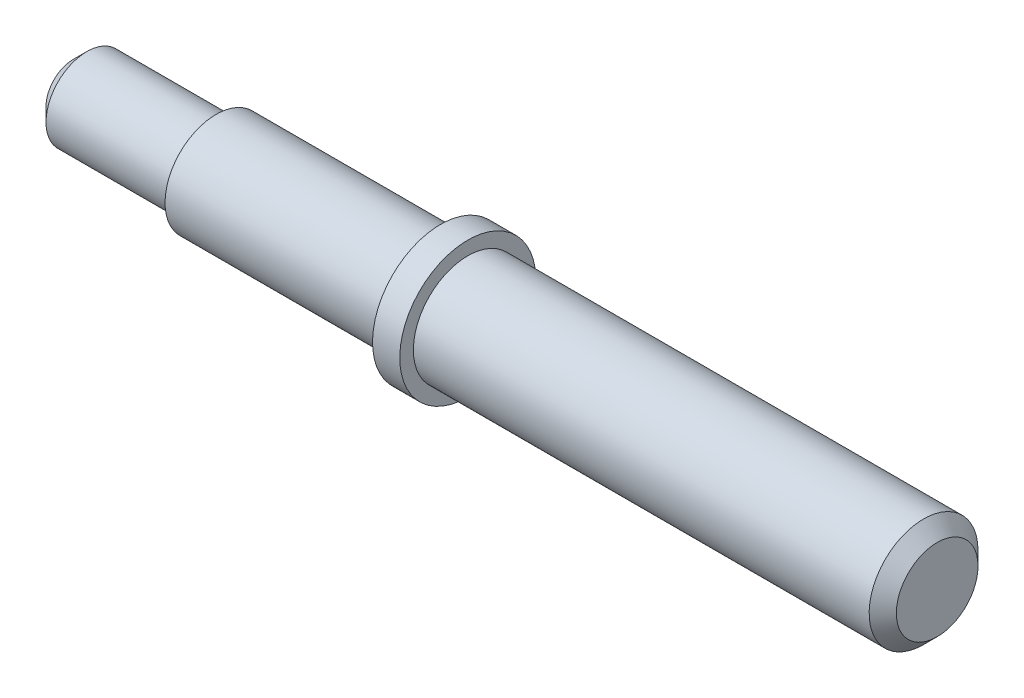
ISO-10303-21;
HEADER;
FILE_DESCRIPTION(('STEP AP214'),'2;1');
FILE_NAME('part.step','',(''),(''),'','','');
FILE_SCHEMA(('AUTOMOTIVE_DESIGN { 1 0 10303 214 1 1 1 1 }'));
ENDSEC;
DATA;
#1=APPLICATION_CONTEXT('core data for automotive mechanical design processes');
#2=APPLICATION_PROTOCOL_DEFINITION('international standard','automotive_design',2000,#1);
#3=PRODUCT_CONTEXT('',#1,'mechanical');
#4=PRODUCT('Part','Part','',(#3));
#5=PRODUCT_RELATED_PRODUCT_CATEGORY('part','',(#4));
#6=PRODUCT_DEFINITION_FORMATION('','',#4);
#7=PRODUCT_DEFINITION_CONTEXT('part definition',#1,'design');
#8=PRODUCT_DEFINITION('design','',#6,#7);
#9=PRODUCT_DEFINITION_SHAPE('','',#8);
#10=(LENGTH_UNIT() NAMED_UNIT(*) SI_UNIT(.MILLI.,.METRE.));
#11=(NAMED_UNIT(*) PLANE_ANGLE_UNIT() SI_UNIT($,.RADIAN.));
#12=(NAMED_UNIT(*) SI_UNIT($,.STERADIAN.) SOLID_ANGLE_UNIT());
#13=UNCERTAINTY_MEASURE_WITH_UNIT(LENGTH_MEASURE(1.E-05),#10,'distance_accuracy_value','');
#14=(GEOMETRIC_REPRESENTATION_CONTEXT(3) GLOBAL_UNCERTAINTY_ASSIGNED_CONTEXT((#13)) GLOBAL_UNIT_ASSIGNED_CONTEXT((#10,
#11,#12)) REPRESENTATION_CONTEXT('',''));
#15=CARTESIAN_POINT('',(0.,0.,0.));
#16=DIRECTION('',(0.,0.,1.));
#17=DIRECTION('',(1.,0.,0.));
#18=AXIS2_PLACEMENT_3D('',#15,#16,#17);
#19=CARTESIAN_POINT('',(-127.,7.99999999999998,0.));
#20=DIRECTION('',(-1.,0.,0.));
#21=DIRECTION('',(0.,-1.,0.));
#22=AXIS2_PLACEMENT_3D('',#19,#20,#21);
#23=CYLINDRICAL_SURFACE('',#22,7.5);
#24=CARTESIAN_POINT('',(-73.,7.99999999999998,0.));
#25=DIRECTION('',(-1.,0.,0.));
#26=DIRECTION('',(0.,-1.,0.));
#27=AXIS2_PLACEMENT_3D('',#24,#25,#26);
#28=CIRCLE('',#27,7.5);
#29=CARTESIAN_POINT('',(-73.,0.499999999999984,0.));
#30=VERTEX_POINT('',#29);
#31=EDGE_CURVE('E63',#30,#30,#28,.T.);
#32=ORIENTED_EDGE('',*,*,#31,.T.);
#33=EDGE_LOOP('',(#32));
#34=FACE_BOUND('',#33,.T.);
#35=CARTESIAN_POINT('',(-106.,7.99999999999998,0.));
#36=DIRECTION('',(-1.,0.,0.));
#37=DIRECTION('',(0.,-1.,0.));
#38=AXIS2_PLACEMENT_3D('',#35,#36,#37);
#39=CIRCLE('',#38,7.50000000000002);
#40=CARTESIAN_POINT('',(-106.,0.499999999999961,0.));
#41=VERTEX_POINT('',#40);
#42=EDGE_CURVE('E66',#41,#41,#39,.T.);
#43=ORIENTED_EDGE('',*,*,#42,.F.);
#44=EDGE_LOOP('',(#43));
#45=FACE_BOUND('',#44,.T.);
#46=ADVANCED_FACE('F34',(#34,#45),#23,.T.);
#47=CARTESIAN_POINT('',(0.,7.99999999999999,0.));
#48=DIRECTION('',(1.,0.,0.));
#49=DIRECTION('',(0.,1.,0.));
#50=AXIS2_PLACEMENT_3D('',#47,#48,#49);
#51=PLANE('',#50);
#52=CARTESIAN_POINT('',(0.,7.99999999999999,0.));
#53=DIRECTION('',(1.,0.,0.));
#54=DIRECTION('',(0.,1.,0.));
#55=AXIS2_PLACEMENT_3D('',#52,#53,#54);
#56=CIRCLE('',#55,5.99999999999995);
#57=CARTESIAN_POINT('',(0.,13.9999999999999,0.));
#58=VERTEX_POINT('',#57);
#59=EDGE_CURVE('E10',#58,#58,#56,.T.);
#60=ORIENTED_EDGE('',*,*,#59,.T.);
#61=EDGE_LOOP('',(#60));
#62=FACE_BOUND('',#61,.T.);
#63=ADVANCED_FACE('F83',(#62),#51,.T.);
#64=CARTESIAN_POINT('',(-127.,7.99999999999998,0.));
#65=DIRECTION('',(-1.,0.,0.));
#66=DIRECTION('',(0.,-1.,0.));
#67=AXIS2_PLACEMENT_3D('',#64,#65,#66);
#68=CYLINDRICAL_SURFACE('',#67,7.99999999999999);
#69=CARTESIAN_POINT('',(-2.00000000000003,7.99999999999999,0.));
#70=DIRECTION('',(1.,0.,0.));
#71=DIRECTION('',(0.,0.,-1.));
#72=AXIS2_PLACEMENT_3D('',#69,#70,#71);
#73=CIRCLE('',#72,7.99999999999999);
#74=CARTESIAN_POINT('',(-2.00000000000003,7.99999999999999,-7.99999999999999));
#75=VERTEX_POINT('',#74);
#76=EDGE_CURVE('E41',#75,#75,#73,.F.);
#77=ORIENTED_EDGE('',*,*,#76,.T.);
#78=EDGE_LOOP('',(#77));
#79=FACE_BOUND('',#78,.T.);
#80=CARTESIAN_POINT('',(-69.,7.99999999999998,0.));
#81=DIRECTION('',(-1.,0.,0.));
#82=DIRECTION('',(0.,-1.,0.));
#83=AXIS2_PLACEMENT_3D('',#80,#81,#82);
#84=CIRCLE('',#83,7.99999999999999);
#85=CARTESIAN_POINT('',(-69.,0.,0.));
#86=VERTEX_POINT('',#85);
#87=EDGE_CURVE('E54',#86,#86,#84,.T.);
#88=ORIENTED_EDGE('',*,*,#87,.F.);
#89=EDGE_LOOP('',(#88));
#90=FACE_BOUND('',#89,.T.);
#91=ADVANCED_FACE('F90',(#79,#90),#68,.T.);
#92=CARTESIAN_POINT('',(-69.,0.,0.));
#93=DIRECTION('',(1.,0.,0.));
#94=DIRECTION('',(0.,1.,0.));
#95=AXIS2_PLACEMENT_3D('',#92,#93,#94);
#96=PLANE('',#95);
#97=ORIENTED_EDGE('',*,*,#87,.T.);
#98=EDGE_LOOP('',(#97));
#99=FACE_BOUND('',#98,.T.);
#100=CARTESIAN_POINT('',(-69.,7.99999999999998,0.));
#101=DIRECTION('',(-1.,0.,0.));
#102=DIRECTION('',(0.,-1.,0.));
#103=AXIS2_PLACEMENT_3D('',#100,#101,#102);
#104=CIRCLE('',#103,10.);
#105=CARTESIAN_POINT('',(-69.,-2.00000000000002,0.));
#106=VERTEX_POINT('',#105);
#107=EDGE_CURVE('E57',#106,#106,#104,.T.);
#108=ORIENTED_EDGE('',*,*,#107,.F.);
#109=EDGE_LOOP('',(#108));
#110=FACE_BOUND('',#109,.T.);
#111=ADVANCED_FACE('F101',(#99,#110),#96,.T.);
#112=CARTESIAN_POINT('',(-127.,7.99999999999998,0.));
#113=DIRECTION('',(-1.,0.,0.));
#114=DIRECTION('',(0.,-1.,0.));
#115=AXIS2_PLACEMENT_3D('',#112,#113,#114);
#116=CYLINDRICAL_SURFACE('',#115,10.);
#117=ORIENTED_EDGE('',*,*,#107,.T.);
#118=EDGE_LOOP('',(#117));
#119=FACE_BOUND('',#118,.T.);
#120=CARTESIAN_POINT('',(-73.,7.99999999999998,0.));
#121=DIRECTION('',(-1.,0.,0.));
#122=DIRECTION('',(0.,-1.,0.));
#123=AXIS2_PLACEMENT_3D('',#120,#121,#122);
#124=CIRCLE('',#123,10.);
#125=CARTESIAN_POINT('',(-73.,-2.00000000000002,0.));
#126=VERTEX_POINT('',#125);
#127=EDGE_CURVE('E60',#126,#126,#124,.T.);
#128=ORIENTED_EDGE('',*,*,#127,.F.);
#129=EDGE_LOOP('',(#128));
#130=FACE_BOUND('',#129,.T.);
#131=ADVANCED_FACE('F97',(#119,#130),#116,.T.);
#132=CARTESIAN_POINT('',(-73.,-2.00000000000002,0.));
#133=DIRECTION('',(-1.,0.,0.));
#134=DIRECTION('',(0.,-1.,0.));
#135=AXIS2_PLACEMENT_3D('',#132,#133,#134);
#136=PLANE('',#135);
#137=ORIENTED_EDGE('',*,*,#127,.T.);
#138=EDGE_LOOP('',(#137));
#139=FACE_BOUND('',#138,.T.);
#140=ORIENTED_EDGE('',*,*,#31,.F.);
#141=EDGE_LOOP('',(#140));
#142=FACE_BOUND('',#141,.T.);
#143=ADVANCED_FACE('F78',(#139,#142),#136,.T.);
#144=CARTESIAN_POINT('',(-106.,7.99999999999998,0.));
#145=DIRECTION('',(-1.,0.,0.));
#146=DIRECTION('',(0.,-1.,0.));
#147=AXIS2_PLACEMENT_3D('',#144,#145,#146);
#148=PLANE('',#147);
#149=CARTESIAN_POINT('',(-106.,7.99999999999998,0.));
#150=DIRECTION('',(-1.,0.,0.));
#151=DIRECTION('',(0.,-1.,0.));
#152=AXIS2_PLACEMENT_3D('',#149,#150,#151);
#153=CIRCLE('',#152,6.);
#154=CARTESIAN_POINT('',(-106.,1.99999999999998,0.));
#155=VERTEX_POINT('',#154);
#156=EDGE_CURVE('E69',#155,#155,#153,.T.);
#157=ORIENTED_EDGE('',*,*,#156,.F.);
#158=EDGE_LOOP('',(#157));
#159=FACE_BOUND('',#158,.T.);
#160=ORIENTED_EDGE('',*,*,#42,.T.);
#161=EDGE_LOOP('',(#160));
#162=FACE_BOUND('',#161,.T.);
#163=ADVANCED_FACE('F75',(#159,#162),#148,.T.);
#164=CARTESIAN_POINT('',(-106.,7.99999999999998,0.));
#165=DIRECTION('',(-1.,0.,0.));
#166=DIRECTION('',(0.,-1.,0.));
#167=AXIS2_PLACEMENT_3D('',#164,#165,#166);
#168=CYLINDRICAL_SURFACE('',#167,6.);
#169=CARTESIAN_POINT('',(-125.,7.99999999999998,0.));
#170=DIRECTION('',(-1.,0.,0.));
#171=DIRECTION('',(0.,0.,1.));
#172=AXIS2_PLACEMENT_3D('',#169,#170,#171);
#173=CIRCLE('',#172,6.);
#174=CARTESIAN_POINT('',(-125.,7.99999999999998,6.));
#175=VERTEX_POINT('',#174);
#176=EDGE_CURVE('E45',#175,#175,#173,.F.);
#177=ORIENTED_EDGE('',*,*,#176,.T.);
#178=EDGE_LOOP('',(#177));
#179=FACE_BOUND('',#178,.T.);
#180=ORIENTED_EDGE('',*,*,#156,.T.);
#181=EDGE_LOOP('',(#180));
#182=FACE_BOUND('',#181,.T.);
#183=ADVANCED_FACE('F73',(#179,#182),#168,.T.);
#184=CARTESIAN_POINT('',(-127.,0.499999999999978,0.));
#185=DIRECTION('',(-1.,0.,0.));
#186=DIRECTION('',(0.,-1.,0.));
#187=AXIS2_PLACEMENT_3D('',#184,#185,#186);
#188=PLANE('',#187);
#189=CARTESIAN_POINT('',(-127.,7.99999999999998,0.));
#190=DIRECTION('',(-1.,0.,0.));
#191=DIRECTION('',(0.,-1.,0.));
#192=AXIS2_PLACEMENT_3D('',#189,#190,#191);
#193=CIRCLE('',#192,4.00000000000006);
#194=CARTESIAN_POINT('',(-127.,3.99999999999993,0.));
#195=VERTEX_POINT('',#194);
#196=EDGE_CURVE('E49',#195,#195,#193,.T.);
#197=ORIENTED_EDGE('',*,*,#196,.T.);
#198=EDGE_LOOP('',(#197));
#199=FACE_BOUND('',#198,.T.);
#200=ADVANCED_FACE('F94',(#199),#188,.T.);
#201=CARTESIAN_POINT('',(-127.,7.99999999999998,0.));
#202=DIRECTION('',(1.,0.,0.));
#203=DIRECTION('',(0.,0.,-1.));
#204=AXIS2_PLACEMENT_3D('',#201,#202,#203);
#205=CONICAL_SURFACE('',#204,4.00000000000006,0.785398163397447);
#206=ORIENTED_EDGE('',*,*,#176,.F.);
#207=EDGE_LOOP('',(#206));
#208=FACE_BOUND('',#207,.T.);
#209=ORIENTED_EDGE('',*,*,#196,.F.);
#210=EDGE_LOOP('',(#209));
#211=FACE_BOUND('',#210,.T.);
#212=ADVANCED_FACE('F107',(#208,#211),#205,.T.);
#213=CARTESIAN_POINT('',(-2.00000000000003,7.99999999999999,0.));
#214=DIRECTION('',(-1.,0.,0.));
#215=DIRECTION('',(0.,0.,1.));
#216=AXIS2_PLACEMENT_3D('',#213,#214,#215);
#217=CONICAL_SURFACE('',#216,7.99999999999999,0.785398163397451);
#218=ORIENTED_EDGE('',*,*,#59,.F.);
#219=EDGE_LOOP('',(#218));
#220=FACE_BOUND('',#219,.T.);
#221=ORIENTED_EDGE('',*,*,#76,.F.);
#222=EDGE_LOOP('',(#221));
#223=FACE_BOUND('',#222,.T.);
#224=ADVANCED_FACE('F36',(#220,#223),#217,.T.);
#225=CLOSED_SHELL('',(#46,#63,#91,#111,#131,#143,#163,#183,#200,#212,#224));
#226=MANIFOLD_SOLID_BREP('B2',#225);
#227=ADVANCED_BREP_SHAPE_REPRESENTATION('',(#18,#226),#14);
#228=SHAPE_DEFINITION_REPRESENTATION(#9,#227);
ENDSEC;
END-ISO-10303-21;
